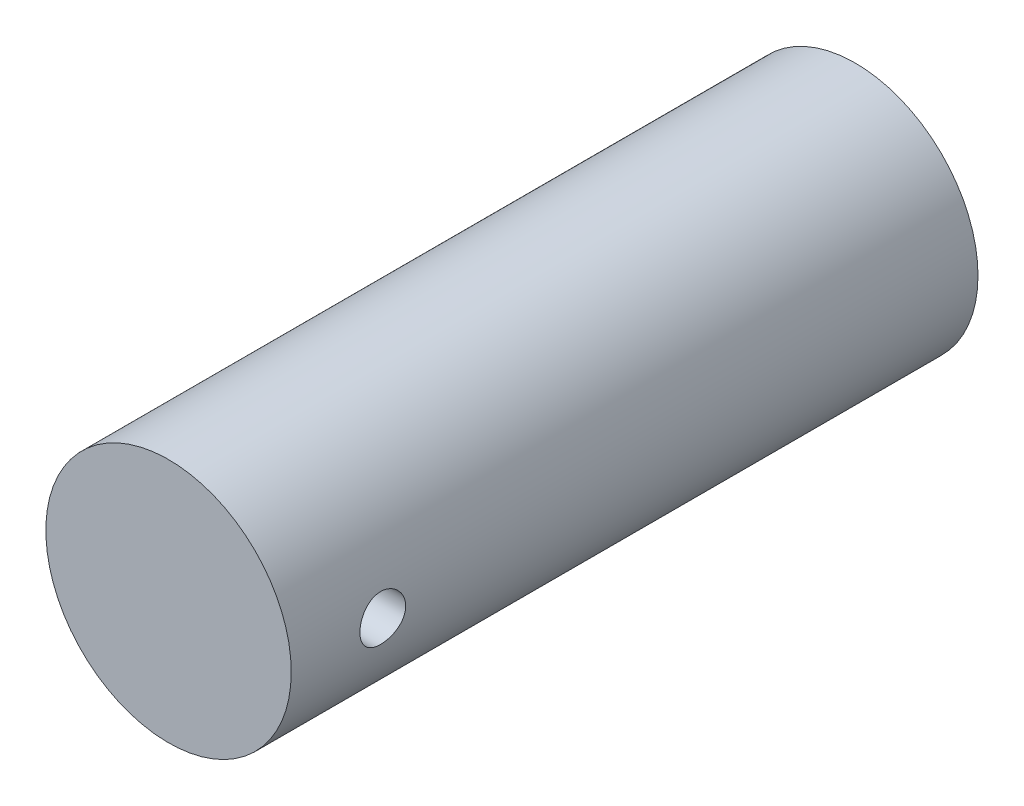
ISO-10303-21;
HEADER;
FILE_DESCRIPTION(('STEP AP214'),'2;1');
FILE_NAME('part.step','',(''),(''),'','','');
FILE_SCHEMA(('AUTOMOTIVE_DESIGN { 1 0 10303 214 1 1 1 1 }'));
ENDSEC;
DATA;
#1=APPLICATION_CONTEXT('core data for automotive mechanical design processes');
#2=APPLICATION_PROTOCOL_DEFINITION('international standard','automotive_design',2000,#1);
#3=PRODUCT_CONTEXT('',#1,'mechanical');
#4=PRODUCT('Part','Part','',(#3));
#5=PRODUCT_RELATED_PRODUCT_CATEGORY('part','',(#4));
#6=PRODUCT_DEFINITION_FORMATION('','',#4);
#7=PRODUCT_DEFINITION_CONTEXT('part definition',#1,'design');
#8=PRODUCT_DEFINITION('design','',#6,#7);
#9=PRODUCT_DEFINITION_SHAPE('','',#8);
#10=(LENGTH_UNIT() NAMED_UNIT(*) SI_UNIT(.MILLI.,.METRE.));
#11=(NAMED_UNIT(*) PLANE_ANGLE_UNIT() SI_UNIT($,.RADIAN.));
#12=(NAMED_UNIT(*) SI_UNIT($,.STERADIAN.) SOLID_ANGLE_UNIT());
#13=UNCERTAINTY_MEASURE_WITH_UNIT(LENGTH_MEASURE(1.E-05),#10,'distance_accuracy_value','');
#14=(GEOMETRIC_REPRESENTATION_CONTEXT(3) GLOBAL_UNCERTAINTY_ASSIGNED_CONTEXT((#13)) GLOBAL_UNIT_ASSIGNED_CONTEXT((#10,
#11,#12)) REPRESENTATION_CONTEXT('',''));
#15=CARTESIAN_POINT('',(0.,0.,0.));
#16=DIRECTION('',(0.,0.,1.));
#17=DIRECTION('',(1.,0.,0.));
#18=AXIS2_PLACEMENT_3D('',#15,#16,#17);
#19=CARTESIAN_POINT('',(0.,0.,47.625));
#20=DIRECTION('',(0.,0.,-1.));
#21=DIRECTION('',(-1.,0.,0.));
#22=AXIS2_PLACEMENT_3D('',#19,#20,#21);
#23=CYLINDRICAL_SURFACE('',#22,8.509);
#24=CARTESIAN_POINT('',(0.,0.,47.625));
#25=DIRECTION('',(0.,0.,1.));
#26=DIRECTION('',(1.,0.,0.));
#27=AXIS2_PLACEMENT_3D('',#24,#25,#26);
#28=CIRCLE('',#27,8.509);
#29=CARTESIAN_POINT('',(8.509,0.,47.625));
#30=VERTEX_POINT('',#29);
#31=EDGE_CURVE('E10',#30,#30,#28,.T.);
#32=ORIENTED_EDGE('',*,*,#31,.F.);
#33=EDGE_LOOP('',(#32));
#34=FACE_BOUND('',#33,.T.);
#35=CARTESIAN_POINT('',(0.,0.,0.));
#36=DIRECTION('',(0.,0.,1.));
#37=DIRECTION('',(1.,0.,0.));
#38=AXIS2_PLACEMENT_3D('',#35,#36,#37);
#39=CIRCLE('',#38,8.509);
#40=CARTESIAN_POINT('',(8.509,0.,0.));
#41=VERTEX_POINT('',#40);
#42=EDGE_CURVE('E46',#41,#41,#39,.T.);
#43=ORIENTED_EDGE('',*,*,#42,.T.);
#44=EDGE_LOOP('',(#43));
#45=FACE_BOUND('',#44,.T.);
#46=CARTESIAN_POINT('',(8.509,0.,42.8625));
#47=CARTESIAN_POINT('',(8.50899840287789,-0.0883490584258998,42.86249661549));
#48=CARTESIAN_POINT('',(8.50760979296225,-0.176742245279739,42.8550997492599));
#49=CARTESIAN_POINT('',(8.50220418974004,-0.351038301642841,42.8257264535026));
#50=CARTESIAN_POINT('',(8.49818496882266,-0.436938996060258,42.8037376672657));
#51=CARTESIAN_POINT('',(8.4879678009925,-0.603704113521514,42.7458767959224));
#52=CARTESIAN_POINT('',(8.48177181347841,-0.684572989110684,42.710017193595));
#53=CARTESIAN_POINT('',(8.46787792627516,-0.839138826981299,42.6254679169743));
#54=CARTESIAN_POINT('',(8.46018015051701,-0.912836380305042,42.5767793012444));
#55=CARTESIAN_POINT('',(8.44403040917822,-1.05184935936863,42.4673409460066));
#56=CARTESIAN_POINT('',(8.43557129985889,-1.11706741402319,42.4064685632822));
#57=CARTESIAN_POINT('',(8.41890538412066,-1.23642779848546,42.2746544469641));
#58=CARTESIAN_POINT('',(8.41069859575298,-1.29056933743125,42.2037119949809));
#59=CARTESIAN_POINT('',(8.39539709718418,-1.38664410919884,42.0530843099341));
#60=CARTESIAN_POINT('',(8.38831159864429,-1.42847842173276,41.9733349645158));
#61=CARTESIAN_POINT('',(8.37615550848895,-1.49811800146932,41.8077858159139));
#62=CARTESIAN_POINT('',(8.37108474492283,-1.52592446595489,41.721986529808));
#63=CARTESIAN_POINT('',(8.36360411762246,-1.56640679562062,41.5478144377496));
#64=CARTESIAN_POINT('',(8.361164428238,-1.57925239244257,41.4594823883701));
#65=CARTESIAN_POINT('',(8.35913224265225,-1.58997515733712,41.2818856809709));
#66=CARTESIAN_POINT('',(8.35953949368966,-1.5878536542409,41.1926211064465));
#67=CARTESIAN_POINT('',(8.36312801647945,-1.56884010082255,41.0169220777743));
#68=CARTESIAN_POINT('',(8.36627305965146,-1.55214094517762,40.9304659000562));
#69=CARTESIAN_POINT('',(8.37492590318637,-1.50474984449326,40.7616042076382));
#70=CARTESIAN_POINT('',(8.38043380304632,-1.47405731020608,40.6791988636768));
#71=CARTESIAN_POINT('',(8.39322968990999,-1.39936173123737,40.5202130085925));
#72=CARTESIAN_POINT('',(8.40052805772938,-1.35528069422079,40.4436700102345));
#73=CARTESIAN_POINT('',(8.41607565790507,-1.25511457742285,40.2989945128524));
#74=CARTESIAN_POINT('',(8.42432498579847,-1.19902829106219,40.230862860291));
#75=CARTESIAN_POINT('',(8.44100293472271,-1.07540323914774,40.1038294708339));
#76=CARTESIAN_POINT('',(8.44943234514008,-1.00769946035319,40.0450883055));
#77=CARTESIAN_POINT('',(8.46540237593212,-0.863313730711623,39.9397733670674));
#78=CARTESIAN_POINT('',(8.47294298756219,-0.786631691545275,39.8931997136753));
#79=CARTESIAN_POINT('',(8.48630079256618,-0.626299444877622,39.8135186237095));
#80=CARTESIAN_POINT('',(8.49211586139719,-0.542640808500917,39.7804277690448));
#81=CARTESIAN_POINT('',(8.50135093458623,-0.370819785471935,39.7288133217889));
#82=CARTESIAN_POINT('',(8.50477119080197,-0.282657873466926,39.7102881973234));
#83=CARTESIAN_POINT('',(8.50879670769442,-0.10571446639103,39.6885542957477));
#84=CARTESIAN_POINT('',(8.50944240399475,-0.0169608872252193,39.685125490974));
#85=CARTESIAN_POINT('',(8.50795769955892,0.159851459475614,39.6930915271012));
#86=CARTESIAN_POINT('',(8.50582743380843,0.247910260585876,39.7044856472132));
#87=CARTESIAN_POINT('',(8.49905533803246,0.420136349368182,39.7415911623114));
#88=CARTESIAN_POINT('',(8.49443302634753,0.504328433453783,39.7671913368802));
#89=CARTESIAN_POINT('',(8.48319299293892,0.667225556542881,39.8318619932));
#90=CARTESIAN_POINT('',(8.47657513679003,0.745930225459578,39.8709333824332));
#91=CARTESIAN_POINT('',(8.46197723986642,0.896558191395699,39.9619251595676));
#92=CARTESIAN_POINT('',(8.45398322140858,0.968398805054012,40.0139801335138));
#93=CARTESIAN_POINT('',(8.43755607451344,1.10240399058102,40.1292791696428));
#94=CARTESIAN_POINT('',(8.42912290555958,1.16456766752551,40.1925242655351));
#95=CARTESIAN_POINT('',(8.41263394210339,1.27828948481995,40.3294039280577));
#96=CARTESIAN_POINT('',(8.40458456220727,1.32969753856653,40.403164090105));
#97=CARTESIAN_POINT('',(8.38990322749197,1.41939392744706,40.5584023697153));
#98=CARTESIAN_POINT('',(8.38327122032354,1.4576827471583,40.6398802020733));
#99=CARTESIAN_POINT('',(8.37222577472697,1.51984045265676,40.8078581265975));
#100=CARTESIAN_POINT('',(8.36780172748488,1.54377840549647,40.8943319314056));
#101=CARTESIAN_POINT('',(8.3616487611619,1.57676808028992,41.0701643278011));
#102=CARTESIAN_POINT('',(8.35991954137325,1.58582146317464,41.1595225963839));
#103=CARTESIAN_POINT('',(8.35936716368943,1.58872986150101,41.3370842138377));
#104=CARTESIAN_POINT('',(8.36049874203205,1.58282159876807,41.4252836314533));
#105=CARTESIAN_POINT('',(8.36544014755995,1.55649238355075,41.5994086061311));
#106=CARTESIAN_POINT('',(8.36924995912117,1.5360715157289,41.6853341764553));
#107=CARTESIAN_POINT('',(8.37909958640034,1.48139621858897,41.8523466899446));
#108=CARTESIAN_POINT('',(8.38513530785296,1.44716717678889,41.933442201249));
#109=CARTESIAN_POINT('',(8.39875962380401,1.36587298140659,42.0887772350407));
#110=CARTESIAN_POINT('',(8.40634832649395,1.31880693343284,42.1630162793354));
#111=CARTESIAN_POINT('',(8.42236419714436,1.21235074357323,42.3037172695304));
#112=CARTESIAN_POINT('',(8.43080212799476,1.15278823243352,42.3700475956387));
#113=CARTESIAN_POINT('',(8.44748494306784,1.02338950452211,42.4918510737184));
#114=CARTESIAN_POINT('',(8.45572978249388,0.95355093057397,42.5473217278201));
#115=CARTESIAN_POINT('',(8.47118347560362,0.804838075371775,42.6462920403802));
#116=CARTESIAN_POINT('',(8.4783824553848,0.725888904574986,42.6896807570586));
#117=CARTESIAN_POINT('',(8.49083690325014,0.56171290166232,42.7625092110546));
#118=CARTESIAN_POINT('',(8.4960942010223,0.476492070769351,42.7919620878059));
#119=CARTESIAN_POINT('',(8.5029975272798,0.3258473446325,42.8300830853276));
#120=CARTESIAN_POINT('',(8.50523577477178,0.261305670738154,42.8422187146789));
#121=CARTESIAN_POINT('',(8.50823758568179,0.131184091241589,42.8584283278751));
#122=CARTESIAN_POINT('',(8.5090011859542,0.0656042116274985,42.8625025131916));
#123=CARTESIAN_POINT('',(8.509,0.,42.8625));
#124=B_SPLINE_CURVE_WITH_KNOTS('',3,(#46,#47,#48,#49,#50,#51,#52,#53,#54,#55,#56,#57,#58,#59,
#60,#61,#62,#63,#64,#65,#66,#67,#68,#69,#70,#71,#72,#73,#74,#75,#76,#77,#78,#79,#80,#81,#82,#83,
#84,#85,#86,#87,#88,#89,#90,#91,#92,#93,#94,#95,#96,#97,#98,#99,#100,#101,#102,#103,#104,#105,
#106,#107,#108,#109,#110,#111,#112,#113,#114,#115,#116,#117,#118,#119,#120,#121,#122,#123),
.UNSPECIFIED.,.T.,.F.,(4,2,2,2,2,2,2,2,2,2,2,2,2,2,2,2,2,2,2,2,2,2,2,2,2,2,2,2,2,2,2,2,2,2,2,2,
2,2,4),(0.,0.264807261950686,0.52983905426631,0.794632889057389,1.05940488169114,
1.32698984298112,1.59459390314321,1.86429350586092,2.13397008570411,2.40055641678741,
2.66711907970698,2.93020709603329,3.193306191767,3.45796831656155,3.72265705353997,
3.99147503640632,4.26029566386277,4.52944591139869,4.79856784868113,5.06375408831079,
5.32892743330879,5.59205342082101,5.85519713716241,6.12119100753722,6.38720946246006,
6.65672332808816,6.92622723777048,7.19442345837355,7.46258974961653,7.72653973408672,
7.99048817875804,8.2539535273105,8.51743723695054,8.78482730395678,9.05227880217621,
9.32211074438596,9.59168776555155,9.7883271655884,9.98496165115094),.UNSPECIFIED.);
#125=CARTESIAN_POINT('',(8.509,0.,42.8625));
#126=VERTEX_POINT('',#125);
#127=EDGE_CURVE('E52',#126,#126,#124,.T.);
#128=ORIENTED_EDGE('',*,*,#127,.F.);
#129=EDGE_LOOP('',(#128));
#130=FACE_BOUND('',#129,.T.);
#131=CARTESIAN_POINT('',(-8.509,0.,42.8625));
#132=CARTESIAN_POINT('',(-8.50899840287789,0.0883490584258998,42.86249661549));
#133=CARTESIAN_POINT('',(-8.50760979296225,0.176742245279739,42.8550997492599));
#134=CARTESIAN_POINT('',(-8.50220418974004,0.351038301642841,42.8257264535026));
#135=CARTESIAN_POINT('',(-8.49818496882266,0.436938996060258,42.8037376672657));
#136=CARTESIAN_POINT('',(-8.4879678009925,0.603704113521514,42.7458767959224));
#137=CARTESIAN_POINT('',(-8.48177181347841,0.684572989110684,42.710017193595));
#138=CARTESIAN_POINT('',(-8.46787792627516,0.839138826981299,42.6254679169743));
#139=CARTESIAN_POINT('',(-8.46018015051701,0.912836380305042,42.5767793012444));
#140=CARTESIAN_POINT('',(-8.44403040917822,1.05184935936863,42.4673409460066));
#141=CARTESIAN_POINT('',(-8.43557129985889,1.11706741402319,42.4064685632822));
#142=CARTESIAN_POINT('',(-8.41890538412066,1.23642779848546,42.2746544469641));
#143=CARTESIAN_POINT('',(-8.41069859575298,1.29056933743125,42.2037119949809));
#144=CARTESIAN_POINT('',(-8.39539709718418,1.38664410919884,42.0530843099341));
#145=CARTESIAN_POINT('',(-8.38831159864429,1.42847842173276,41.9733349645158));
#146=CARTESIAN_POINT('',(-8.37615550848895,1.49811800146932,41.8077858159139));
#147=CARTESIAN_POINT('',(-8.37108474492283,1.52592446595489,41.721986529808));
#148=CARTESIAN_POINT('',(-8.36360411762246,1.56640679562062,41.5478144377496));
#149=CARTESIAN_POINT('',(-8.361164428238,1.57925239244257,41.4594823883701));
#150=CARTESIAN_POINT('',(-8.35913224265225,1.58997515733712,41.2818856809709));
#151=CARTESIAN_POINT('',(-8.35953949368966,1.5878536542409,41.1926211064465));
#152=CARTESIAN_POINT('',(-8.36312801647945,1.56884010082255,41.0169220777743));
#153=CARTESIAN_POINT('',(-8.36627305965146,1.55214094517762,40.9304659000562));
#154=CARTESIAN_POINT('',(-8.37492590318637,1.50474984449326,40.7616042076382));
#155=CARTESIAN_POINT('',(-8.38043380304632,1.47405731020608,40.6791988636768));
#156=CARTESIAN_POINT('',(-8.39322968990999,1.39936173123737,40.5202130085925));
#157=CARTESIAN_POINT('',(-8.40052805772938,1.35528069422079,40.4436700102345));
#158=CARTESIAN_POINT('',(-8.41607565790507,1.25511457742285,40.2989945128524));
#159=CARTESIAN_POINT('',(-8.42432498579847,1.19902829106219,40.230862860291));
#160=CARTESIAN_POINT('',(-8.44100293472271,1.07540323914774,40.1038294708339));
#161=CARTESIAN_POINT('',(-8.44943234514008,1.00769946035319,40.0450883055));
#162=CARTESIAN_POINT('',(-8.46540237593212,0.863313730711623,39.9397733670674));
#163=CARTESIAN_POINT('',(-8.47294298756219,0.786631691545275,39.8931997136753));
#164=CARTESIAN_POINT('',(-8.48630079256618,0.626299444877622,39.8135186237095));
#165=CARTESIAN_POINT('',(-8.49211586139719,0.542640808500917,39.7804277690448));
#166=CARTESIAN_POINT('',(-8.50135093458623,0.370819785471935,39.7288133217889));
#167=CARTESIAN_POINT('',(-8.50477119080197,0.282657873466926,39.7102881973234));
#168=CARTESIAN_POINT('',(-8.50879670769442,0.10571446639103,39.6885542957477));
#169=CARTESIAN_POINT('',(-8.50944240399475,0.0169608872252193,39.685125490974));
#170=CARTESIAN_POINT('',(-8.50795769955892,-0.159851459475614,39.6930915271012));
#171=CARTESIAN_POINT('',(-8.50582743380843,-0.247910260585876,39.7044856472132));
#172=CARTESIAN_POINT('',(-8.49905533803246,-0.420136349368182,39.7415911623114));
#173=CARTESIAN_POINT('',(-8.49443302634753,-0.504328433453783,39.7671913368802));
#174=CARTESIAN_POINT('',(-8.48319299293892,-0.667225556542881,39.8318619932));
#175=CARTESIAN_POINT('',(-8.47657513679003,-0.745930225459578,39.8709333824332));
#176=CARTESIAN_POINT('',(-8.46197723986642,-0.896558191395699,39.9619251595676));
#177=CARTESIAN_POINT('',(-8.45398322140858,-0.968398805054012,40.0139801335138));
#178=CARTESIAN_POINT('',(-8.43755607451344,-1.10240399058102,40.1292791696428));
#179=CARTESIAN_POINT('',(-8.42912290555958,-1.16456766752551,40.1925242655351));
#180=CARTESIAN_POINT('',(-8.41263394210339,-1.27828948481995,40.3294039280577));
#181=CARTESIAN_POINT('',(-8.40458456220727,-1.32969753856653,40.403164090105));
#182=CARTESIAN_POINT('',(-8.38990322749197,-1.41939392744706,40.5584023697153));
#183=CARTESIAN_POINT('',(-8.38327122032354,-1.4576827471583,40.6398802020733));
#184=CARTESIAN_POINT('',(-8.37222577472697,-1.51984045265676,40.8078581265975));
#185=CARTESIAN_POINT('',(-8.36780172748488,-1.54377840549647,40.8943319314056));
#186=CARTESIAN_POINT('',(-8.3616487611619,-1.57676808028992,41.0701643278011));
#187=CARTESIAN_POINT('',(-8.35991954137325,-1.58582146317464,41.1595225963839));
#188=CARTESIAN_POINT('',(-8.35936716368943,-1.58872986150101,41.3370842138377));
#189=CARTESIAN_POINT('',(-8.36049874203205,-1.58282159876807,41.4252836314533));
#190=CARTESIAN_POINT('',(-8.36544014755995,-1.55649238355075,41.5994086061311));
#191=CARTESIAN_POINT('',(-8.36924995912117,-1.5360715157289,41.6853341764553));
#192=CARTESIAN_POINT('',(-8.37909958640034,-1.48139621858897,41.8523466899446));
#193=CARTESIAN_POINT('',(-8.38513530785296,-1.44716717678889,41.933442201249));
#194=CARTESIAN_POINT('',(-8.39875962380401,-1.36587298140659,42.0887772350407));
#195=CARTESIAN_POINT('',(-8.40634832649395,-1.31880693343284,42.1630162793354));
#196=CARTESIAN_POINT('',(-8.42236419714436,-1.21235074357323,42.3037172695304));
#197=CARTESIAN_POINT('',(-8.43080212799476,-1.15278823243352,42.3700475956387));
#198=CARTESIAN_POINT('',(-8.44748494306784,-1.02338950452211,42.4918510737184));
#199=CARTESIAN_POINT('',(-8.45572978249388,-0.95355093057397,42.5473217278201));
#200=CARTESIAN_POINT('',(-8.47118347560362,-0.804838075371775,42.6462920403802));
#201=CARTESIAN_POINT('',(-8.4783824553848,-0.725888904574986,42.6896807570586));
#202=CARTESIAN_POINT('',(-8.49083690325014,-0.56171290166232,42.7625092110546));
#203=CARTESIAN_POINT('',(-8.4960942010223,-0.476492070769351,42.7919620878059));
#204=CARTESIAN_POINT('',(-8.5029975272798,-0.3258473446325,42.8300830853276));
#205=CARTESIAN_POINT('',(-8.50523577477178,-0.261305670738154,42.8422187146789));
#206=CARTESIAN_POINT('',(-8.50823758568179,-0.131184091241589,42.8584283278751));
#207=CARTESIAN_POINT('',(-8.5090011859542,-0.0656042116274985,42.8625025131916));
#208=CARTESIAN_POINT('',(-8.509,0.,42.8625));
#209=B_SPLINE_CURVE_WITH_KNOTS('',3,(#131,#132,#133,#134,#135,#136,#137,#138,#139,#140,#141,
#142,#143,#144,#145,#146,#147,#148,#149,#150,#151,#152,#153,#154,#155,#156,#157,#158,#159,#160,
#161,#162,#163,#164,#165,#166,#167,#168,#169,#170,#171,#172,#173,#174,#175,#176,#177,#178,#179,
#180,#181,#182,#183,#184,#185,#186,#187,#188,#189,#190,#191,#192,#193,#194,#195,#196,#197,#198,
#199,#200,#201,#202,#203,#204,#205,#206,#207,#208),.UNSPECIFIED.,.T.,.F.,(4,2,2,2,2,2,2,2,2,2,2,
2,2,2,2,2,2,2,2,2,2,2,2,2,2,2,2,2,2,2,2,2,2,2,2,2,2,2,4),(0.,0.264807261950686,0.52983905426631,
0.794632889057389,1.05940488169114,1.32698984298112,1.59459390314321,1.86429350586092,
2.13397008570411,2.40055641678741,2.66711907970698,2.93020709603329,3.193306191767,
3.45796831656155,3.72265705353997,3.99147503640632,4.26029566386277,4.52944591139869,
4.79856784868113,5.06375408831079,5.32892743330879,5.59205342082101,5.85519713716241,
6.12119100753722,6.38720946246006,6.65672332808816,6.92622723777048,7.19442345837355,
7.46258974961653,7.72653973408672,7.99048817875804,8.2539535273105,8.51743723695054,
8.78482730395678,9.05227880217621,9.32211074438596,9.59168776555155,9.7883271655884,
9.98496165115094),.UNSPECIFIED.);
#210=CARTESIAN_POINT('',(-8.509,0.,42.8625));
#211=VERTEX_POINT('',#210);
#212=EDGE_CURVE('E38',#211,#211,#209,.T.);
#213=ORIENTED_EDGE('',*,*,#212,.F.);
#214=EDGE_LOOP('',(#213));
#215=FACE_BOUND('',#214,.T.);
#216=ADVANCED_FACE('F34',(#34,#45,#130,#215),#23,.T.);
#217=CARTESIAN_POINT('',(0.,0.,47.625));
#218=DIRECTION('',(0.,0.,1.));
#219=DIRECTION('',(1.,0.,0.));
#220=AXIS2_PLACEMENT_3D('',#217,#218,#219);
#221=PLANE('',#220);
#222=ORIENTED_EDGE('',*,*,#31,.T.);
#223=EDGE_LOOP('',(#222));
#224=FACE_BOUND('',#223,.T.);
#225=ADVANCED_FACE('F63',(#224),#221,.T.);
#226=CARTESIAN_POINT('',(0.,0.,0.));
#227=DIRECTION('',(0.,0.,1.));
#228=DIRECTION('',(1.,0.,0.));
#229=AXIS2_PLACEMENT_3D('',#226,#227,#228);
#230=PLANE('',#229);
#231=ORIENTED_EDGE('',*,*,#42,.F.);
#232=EDGE_LOOP('',(#231));
#233=FACE_BOUND('',#232,.T.);
#234=ADVANCED_FACE('F61',(#233),#230,.F.);
#235=CARTESIAN_POINT('',(47.625,0.,41.275));
#236=DIRECTION('',(-1.,0.,0.));
#237=DIRECTION('',(0.,0.,1.));
#238=AXIS2_PLACEMENT_3D('',#235,#236,#237);
#239=CYLINDRICAL_SURFACE('',#238,1.5875);
#240=ORIENTED_EDGE('',*,*,#127,.T.);
#241=EDGE_LOOP('',(#240));
#242=FACE_BOUND('',#241,.T.);
#243=ORIENTED_EDGE('',*,*,#212,.T.);
#244=EDGE_LOOP('',(#243));
#245=FACE_BOUND('',#244,.T.);
#246=ADVANCED_FACE('F57',(#242,#245),#239,.F.);
#247=CLOSED_SHELL('',(#216,#225,#234,#246));
#248=MANIFOLD_SOLID_BREP('B2',#247);
#249=ADVANCED_BREP_SHAPE_REPRESENTATION('',(#18,#248),#14);
#250=SHAPE_DEFINITION_REPRESENTATION(#9,#249);
ENDSEC;
END-ISO-10303-21;
